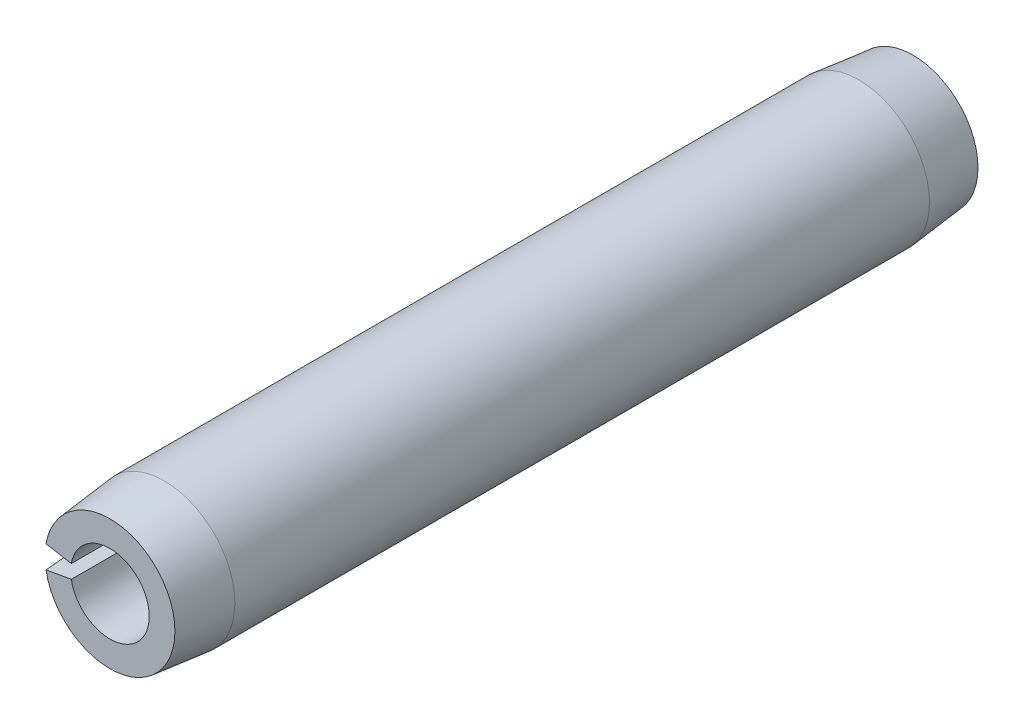
ISO-10303-21;
HEADER;
FILE_DESCRIPTION(('STEP AP214'),'2;1');
FILE_NAME('part.step','',(''),(''),'','','');
FILE_SCHEMA(('AUTOMOTIVE_DESIGN { 1 0 10303 214 1 1 1 1 }'));
ENDSEC;
DATA;
#1=APPLICATION_CONTEXT('core data for automotive mechanical design processes');
#2=APPLICATION_PROTOCOL_DEFINITION('international standard','automotive_design',2000,#1);
#3=PRODUCT_CONTEXT('',#1,'mechanical');
#4=PRODUCT('Part','Part','',(#3));
#5=PRODUCT_RELATED_PRODUCT_CATEGORY('part','',(#4));
#6=PRODUCT_DEFINITION_FORMATION('','',#4);
#7=PRODUCT_DEFINITION_CONTEXT('part definition',#1,'design');
#8=PRODUCT_DEFINITION('design','',#6,#7);
#9=PRODUCT_DEFINITION_SHAPE('','',#8);
#10=(LENGTH_UNIT() NAMED_UNIT(*) SI_UNIT(.MILLI.,.METRE.));
#11=(NAMED_UNIT(*) PLANE_ANGLE_UNIT() SI_UNIT($,.RADIAN.));
#12=(NAMED_UNIT(*) SI_UNIT($,.STERADIAN.) SOLID_ANGLE_UNIT());
#13=UNCERTAINTY_MEASURE_WITH_UNIT(LENGTH_MEASURE(1.E-05),#10,'distance_accuracy_value','');
#14=(GEOMETRIC_REPRESENTATION_CONTEXT(3) GLOBAL_UNCERTAINTY_ASSIGNED_CONTEXT((#13)) GLOBAL_UNIT_ASSIGNED_CONTEXT((#10,
#11,#12)) REPRESENTATION_CONTEXT('',''));
#15=CARTESIAN_POINT('',(0.,0.,0.));
#16=DIRECTION('',(0.,0.,1.));
#17=DIRECTION('',(1.,0.,0.));
#18=AXIS2_PLACEMENT_3D('',#15,#16,#17);
#19=CARTESIAN_POINT('',(0.,0.,7.14375));
#20=DIRECTION('',(0.,0.,-1.));
#21=DIRECTION('',(-1.,0.,0.));
#22=AXIS2_PLACEMENT_3D('',#19,#20,#21);
#23=CYLINDRICAL_SURFACE('',#22,0.6985);
#24=CARTESIAN_POINT('',(0.,0.,-7.14375));
#25=DIRECTION('',(0.,0.,-1.));
#26=DIRECTION('',(1.,0.,0.));
#27=AXIS2_PLACEMENT_3D('',#24,#25,#26);
#28=CIRCLE('',#27,0.6985);
#29=CARTESIAN_POINT('',(-0.687888215479028,0.121293252100349,-7.14375));
#30=VERTEX_POINT('',#29);
#31=CARTESIAN_POINT('',(-0.687888215479028,-0.121293252100349,-7.14375));
#32=VERTEX_POINT('',#31);
#33=EDGE_CURVE('E115',#30,#32,#28,.T.);
#34=ORIENTED_EDGE('',*,*,#33,.T.);
#35=DIRECTION('',(0.,0.,-1.));
#36=VECTOR('',#35,1.);
#37=CARTESIAN_POINT('',(-0.687888215479028,-0.121293252100349,7.14375));
#38=LINE('',#37,#36);
#39=CARTESIAN_POINT('',(-0.687888215479028,-0.121293252100349,7.14375));
#40=VERTEX_POINT('',#39);
#41=EDGE_CURVE('E11',#40,#32,#38,.T.);
#42=ORIENTED_EDGE('',*,*,#41,.F.);
#43=CARTESIAN_POINT('',(0.,0.,7.14375));
#44=DIRECTION('',(0.,0.,-1.));
#45=DIRECTION('',(1.,0.,0.));
#46=AXIS2_PLACEMENT_3D('',#43,#44,#45);
#47=CIRCLE('',#46,0.6985);
#48=CARTESIAN_POINT('',(-0.687888215479028,0.121293252100349,7.14375));
#49=VERTEX_POINT('',#48);
#50=EDGE_CURVE('E111',#49,#40,#47,.T.);
#51=ORIENTED_EDGE('',*,*,#50,.F.);
#52=DIRECTION('',(0.,0.,-1.));
#53=VECTOR('',#52,1.);
#54=CARTESIAN_POINT('',(-0.687888215479028,0.121293252100349,7.14375));
#55=LINE('',#54,#53);
#56=EDGE_CURVE('E104',#49,#30,#55,.T.);
#57=ORIENTED_EDGE('',*,*,#56,.T.);
#58=EDGE_LOOP('',(#34,#42,#51,#57));
#59=FACE_BOUND('',#58,.T.);
#60=ADVANCED_FACE('F32',(#59),#23,.F.);
#61=CARTESIAN_POINT('',(-0.687888215479028,-0.121293252100349,7.14375));
#62=DIRECTION('',(0.173648177666927,-0.984807753012209,0.));
#63=DIRECTION('',(0.984807753012209,0.173648177666927,0.));
#64=AXIS2_PLACEMENT_3D('',#61,#62,#63);
#65=PLANE('',#64);
#66=DIRECTION('',(0.,0.,-1.));
#67=VECTOR('',#66,1.);
#68=CARTESIAN_POINT('',(-1.23819878786225,-0.218327853780627,7.14375));
#69=LINE('',#68,#67);
#70=CARTESIAN_POINT('',(-1.23819878786225,-0.218327853780628,6.17855));
#71=VERTEX_POINT('',#70);
#72=CARTESIAN_POINT('',(-1.23819878786225,-0.218327853780628,-6.17855));
#73=VERTEX_POINT('',#72);
#74=EDGE_CURVE('E39',#71,#73,#69,.T.);
#75=ORIENTED_EDGE('',*,*,#74,.F.);
#76=DIRECTION('',(-0.103094387415781,-0.0181783220610131,-0.994505452921406));
#77=VECTOR('',#76,1.);
#78=CARTESIAN_POINT('',(0.,0.,18.1229));
#79=LINE('',#78,#77);
#80=CARTESIAN_POINT('',(-1.13814232015621,-0.200685198929668,7.14375));
#81=VERTEX_POINT('',#80);
#82=EDGE_CURVE('E86',#71,#81,#79,.F.);
#83=ORIENTED_EDGE('',*,*,#82,.T.);
#84=DIRECTION('',(-0.984807753012209,-0.173648177666927,0.));
#85=VECTOR('',#84,1.);
#86=CARTESIAN_POINT('',(-0.687888215479028,-0.121293252100349,7.14375));
#87=LINE('',#86,#85);
#88=EDGE_CURVE('E119',#40,#81,#87,.T.);
#89=ORIENTED_EDGE('',*,*,#88,.F.);
#90=ORIENTED_EDGE('',*,*,#41,.T.);
#91=DIRECTION('',(-0.984807753012209,-0.173648177666927,0.));
#92=VECTOR('',#91,1.);
#93=CARTESIAN_POINT('',(-0.687888215479028,-0.121293252100349,-7.14375));
#94=LINE('',#93,#92);
#95=CARTESIAN_POINT('',(-1.13814232015621,-0.200685198929668,-7.14375));
#96=VERTEX_POINT('',#95);
#97=EDGE_CURVE('E112',#32,#96,#94,.T.);
#98=ORIENTED_EDGE('',*,*,#97,.T.);
#99=DIRECTION('',(0.103094387415781,0.0181783220610131,-0.994505452921406));
#100=VECTOR('',#99,1.);
#101=CARTESIAN_POINT('',(0.,0.,-18.1229));
#102=LINE('',#101,#100);
#103=EDGE_CURVE('E54',#96,#73,#102,.F.);
#104=ORIENTED_EDGE('',*,*,#103,.T.);
#105=EDGE_LOOP('',(#75,#83,#89,#90,#98,#104));
#106=FACE_BOUND('',#105,.T.);
#107=ADVANCED_FACE('F133',(#106),#65,.F.);
#108=CARTESIAN_POINT('',(0.,0.,7.14375));
#109=DIRECTION('',(0.,0.,-1.));
#110=DIRECTION('',(-1.,0.,0.));
#111=AXIS2_PLACEMENT_3D('',#108,#109,#110);
#112=CYLINDRICAL_SURFACE('',#111,1.2573);
#113=DIRECTION('',(0.,0.,-1.));
#114=VECTOR('',#113,1.);
#115=CARTESIAN_POINT('',(-1.23819878786225,0.218327853780628,7.14375));
#116=LINE('',#115,#114);
#117=CARTESIAN_POINT('',(-1.23819878786225,0.218327853780628,6.17855));
#118=VERTEX_POINT('',#117);
#119=CARTESIAN_POINT('',(-1.23819878786225,0.218327853780628,-6.17855));
#120=VERTEX_POINT('',#119);
#121=EDGE_CURVE('E96',#118,#120,#116,.T.);
#122=ORIENTED_EDGE('',*,*,#121,.F.);
#123=CARTESIAN_POINT('',(0.,0.,6.17855));
#124=DIRECTION('',(0.,0.,-1.));
#125=DIRECTION('',(-1.,0.,0.));
#126=AXIS2_PLACEMENT_3D('',#123,#124,#125);
#127=CIRCLE('',#126,1.2573);
#128=EDGE_CURVE('E83',#118,#71,#127,.T.);
#129=ORIENTED_EDGE('',*,*,#128,.T.);
#130=ORIENTED_EDGE('',*,*,#74,.T.);
#131=CARTESIAN_POINT('',(0.,0.,-6.17855));
#132=DIRECTION('',(0.,0.,-1.));
#133=DIRECTION('',(-1.,0.,0.));
#134=AXIS2_PLACEMENT_3D('',#131,#132,#133);
#135=CIRCLE('',#134,1.2573);
#136=EDGE_CURVE('E103',#120,#73,#135,.T.);
#137=ORIENTED_EDGE('',*,*,#136,.F.);
#138=EDGE_LOOP('',(#122,#129,#130,#137));
#139=FACE_BOUND('',#138,.T.);
#140=ADVANCED_FACE('F102',(#139),#112,.T.);
#141=CARTESIAN_POINT('',(-1.23819878786225,0.218327853780628,7.14375));
#142=DIRECTION('',(0.173648177666927,0.984807753012209,0.));
#143=DIRECTION('',(-0.984807753012209,0.173648177666927,0.));
#144=AXIS2_PLACEMENT_3D('',#141,#142,#143);
#145=PLANE('',#144);
#146=DIRECTION('',(0.984807753012209,-0.173648177666927,0.));
#147=VECTOR('',#146,1.);
#148=CARTESIAN_POINT('',(-1.23819878786225,0.218327853780628,7.14375));
#149=LINE('',#148,#147);
#150=CARTESIAN_POINT('',(-1.13814232015621,0.200685198929668,7.14375));
#151=VERTEX_POINT('',#150);
#152=EDGE_CURVE('E99',#151,#49,#149,.T.);
#153=ORIENTED_EDGE('',*,*,#152,.F.);
#154=DIRECTION('',(0.103094387415781,-0.0181783220610131,0.994505452921406));
#155=VECTOR('',#154,1.);
#156=CARTESIAN_POINT('',(0.,0.,18.1229));
#157=LINE('',#156,#155);
#158=EDGE_CURVE('E46',#151,#118,#157,.F.);
#159=ORIENTED_EDGE('',*,*,#158,.T.);
#160=ORIENTED_EDGE('',*,*,#121,.T.);
#161=DIRECTION('',(-0.103094387415781,0.0181783220610131,0.994505452921406));
#162=VECTOR('',#161,1.);
#163=CARTESIAN_POINT('',(0.,0.,-18.1229));
#164=LINE('',#163,#162);
#165=CARTESIAN_POINT('',(-1.13814232015621,0.200685198929668,-7.14375));
#166=VERTEX_POINT('',#165);
#167=EDGE_CURVE('E125',#120,#166,#164,.F.);
#168=ORIENTED_EDGE('',*,*,#167,.T.);
#169=DIRECTION('',(0.984807753012209,-0.173648177666927,0.));
#170=VECTOR('',#169,1.);
#171=CARTESIAN_POINT('',(-1.23819878786225,0.218327853780628,-7.14375));
#172=LINE('',#171,#170);
#173=EDGE_CURVE('E109',#166,#30,#172,.T.);
#174=ORIENTED_EDGE('',*,*,#173,.T.);
#175=ORIENTED_EDGE('',*,*,#56,.F.);
#176=EDGE_LOOP('',(#153,#159,#160,#168,#174,#175));
#177=FACE_BOUND('',#176,.T.);
#178=ADVANCED_FACE('F94',(#177),#145,.F.);
#179=CARTESIAN_POINT('',(0.,0.,7.14375));
#180=DIRECTION('',(0.,0.,1.));
#181=DIRECTION('',(1.,0.,0.));
#182=AXIS2_PLACEMENT_3D('',#179,#180,#181);
#183=PLANE('',#182);
#184=CARTESIAN_POINT('',(0.,0.,7.14375));
#185=DIRECTION('',(0.,0.,-1.));
#186=DIRECTION('',(-1.,0.,0.));
#187=AXIS2_PLACEMENT_3D('',#184,#185,#186);
#188=CIRCLE('',#187,1.1557);
#189=EDGE_CURVE('E90',#151,#81,#188,.T.);
#190=ORIENTED_EDGE('',*,*,#189,.F.);
#191=ORIENTED_EDGE('',*,*,#152,.T.);
#192=ORIENTED_EDGE('',*,*,#50,.T.);
#193=ORIENTED_EDGE('',*,*,#88,.T.);
#194=EDGE_LOOP('',(#190,#191,#192,#193));
#195=FACE_BOUND('',#194,.T.);
#196=ADVANCED_FACE('F134',(#195),#183,.T.);
#197=CARTESIAN_POINT('',(0.,0.,-7.14375));
#198=DIRECTION('',(0.,0.,1.));
#199=DIRECTION('',(1.,0.,0.));
#200=AXIS2_PLACEMENT_3D('',#197,#198,#199);
#201=PLANE('',#200);
#202=ORIENTED_EDGE('',*,*,#173,.F.);
#203=CARTESIAN_POINT('',(0.,0.,-7.14375));
#204=DIRECTION('',(0.,0.,-1.));
#205=DIRECTION('',(-1.,0.,0.));
#206=AXIS2_PLACEMENT_3D('',#203,#204,#205);
#207=CIRCLE('',#206,1.1557);
#208=EDGE_CURVE('E127',#166,#96,#207,.T.);
#209=ORIENTED_EDGE('',*,*,#208,.T.);
#210=ORIENTED_EDGE('',*,*,#97,.F.);
#211=ORIENTED_EDGE('',*,*,#33,.F.);
#212=EDGE_LOOP('',(#202,#209,#210,#211));
#213=FACE_BOUND('',#212,.T.);
#214=ADVANCED_FACE('F141',(#213),#201,.F.);
#215=CARTESIAN_POINT('',(0.,0.,-6.17855));
#216=DIRECTION('',(0.,0.,1.));
#217=DIRECTION('',(1.,0.,0.));
#218=AXIS2_PLACEMENT_3D('',#215,#216,#217);
#219=CONICAL_SURFACE('',#218,1.2573,0.104876938730234);
#220=ORIENTED_EDGE('',*,*,#208,.F.);
#221=ORIENTED_EDGE('',*,*,#167,.F.);
#222=ORIENTED_EDGE('',*,*,#136,.T.);
#223=ORIENTED_EDGE('',*,*,#103,.F.);
#224=EDGE_LOOP('',(#220,#221,#222,#223));
#225=FACE_BOUND('',#224,.T.);
#226=ADVANCED_FACE('F142',(#225),#219,.T.);
#227=CARTESIAN_POINT('',(0.,0.,7.14375));
#228=DIRECTION('',(0.,0.,-1.));
#229=DIRECTION('',(-1.,0.,0.));
#230=AXIS2_PLACEMENT_3D('',#227,#228,#229);
#231=CONICAL_SURFACE('',#230,1.1557,0.104876938730234);
#232=ORIENTED_EDGE('',*,*,#128,.F.);
#233=ORIENTED_EDGE('',*,*,#158,.F.);
#234=ORIENTED_EDGE('',*,*,#189,.T.);
#235=ORIENTED_EDGE('',*,*,#82,.F.);
#236=EDGE_LOOP('',(#232,#233,#234,#235));
#237=FACE_BOUND('',#236,.T.);
#238=ADVANCED_FACE('F84',(#237),#231,.T.);
#239=CLOSED_SHELL('',(#60,#107,#140,#178,#196,#214,#226,#238));
#240=MANIFOLD_SOLID_BREP('B2',#239);
#241=ADVANCED_BREP_SHAPE_REPRESENTATION('',(#18,#240),#14);
#242=SHAPE_DEFINITION_REPRESENTATION(#9,#241);
ENDSEC;
END-ISO-10303-21;
